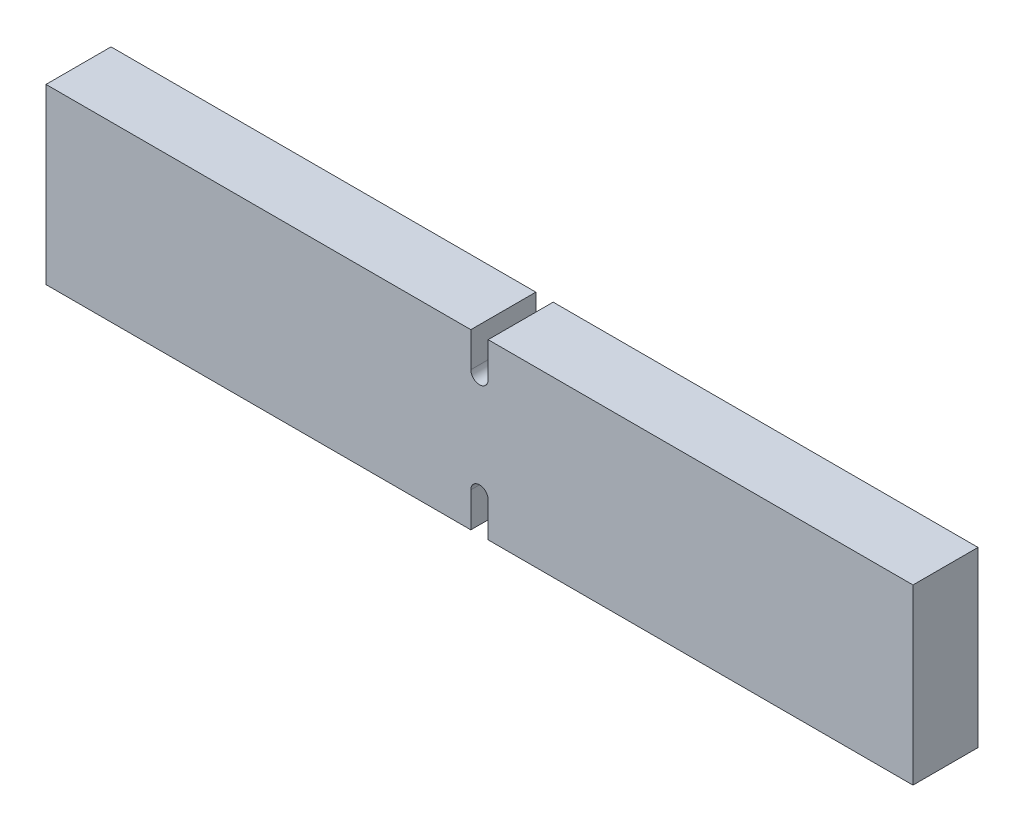
ISO-10303-21;
HEADER;
FILE_DESCRIPTION(('STEP AP214'),'2;1');
FILE_NAME('part.step','',(''),(''),'','','');
FILE_SCHEMA(('AUTOMOTIVE_DESIGN { 1 0 10303 214 1 1 1 1 }'));
ENDSEC;
DATA;
#1=APPLICATION_CONTEXT('core data for automotive mechanical design processes');
#2=APPLICATION_PROTOCOL_DEFINITION('international standard','automotive_design',2000,#1);
#3=PRODUCT_CONTEXT('',#1,'mechanical');
#4=PRODUCT('Part','Part','',(#3));
#5=PRODUCT_RELATED_PRODUCT_CATEGORY('part','',(#4));
#6=PRODUCT_DEFINITION_FORMATION('','',#4);
#7=PRODUCT_DEFINITION_CONTEXT('part definition',#1,'design');
#8=PRODUCT_DEFINITION('design','',#6,#7);
#9=PRODUCT_DEFINITION_SHAPE('','',#8);
#10=(LENGTH_UNIT() NAMED_UNIT(*) SI_UNIT(.MILLI.,.METRE.));
#11=(NAMED_UNIT(*) PLANE_ANGLE_UNIT() SI_UNIT($,.RADIAN.));
#12=(NAMED_UNIT(*) SI_UNIT($,.STERADIAN.) SOLID_ANGLE_UNIT());
#13=UNCERTAINTY_MEASURE_WITH_UNIT(LENGTH_MEASURE(1.E-05),#10,'distance_accuracy_value','');
#14=(GEOMETRIC_REPRESENTATION_CONTEXT(3) GLOBAL_UNCERTAINTY_ASSIGNED_CONTEXT((#13)) GLOBAL_UNIT_ASSIGNED_CONTEXT((#10,
#11,#12)) REPRESENTATION_CONTEXT('',''));
#15=CARTESIAN_POINT('',(0.,0.,0.));
#16=DIRECTION('',(0.,0.,1.));
#17=DIRECTION('',(1.,0.,0.));
#18=AXIS2_PLACEMENT_3D('',#15,#16,#17);
#19=CARTESIAN_POINT('',(-100.,-20.,15.));
#20=DIRECTION('',(0.,1.,0.));
#21=DIRECTION('',(-1.,0.,0.));
#22=AXIS2_PLACEMENT_3D('',#19,#20,#21);
#23=PLANE('',#22);
#24=DIRECTION('',(1.,0.,0.));
#25=VECTOR('',#24,1.);
#26=CARTESIAN_POINT('',(-100.,-20.,0.));
#27=LINE('',#26,#25);
#28=CARTESIAN_POINT('',(-100.,-20.,0.));
#29=VERTEX_POINT('',#28);
#30=CARTESIAN_POINT('',(-2.,-20.,0.));
#31=VERTEX_POINT('',#30);
#32=EDGE_CURVE('E144',#29,#31,#27,.T.);
#33=ORIENTED_EDGE('',*,*,#32,.T.);
#34=DIRECTION('',(0.,0.,1.));
#35=VECTOR('',#34,1.);
#36=CARTESIAN_POINT('',(-2.,-20.,0.));
#37=LINE('',#36,#35);
#38=CARTESIAN_POINT('',(-2.,-20.,15.));
#39=VERTEX_POINT('',#38);
#40=EDGE_CURVE('E213',#31,#39,#37,.T.);
#41=ORIENTED_EDGE('',*,*,#40,.T.);
#42=DIRECTION('',(1.,0.,0.));
#43=VECTOR('',#42,1.);
#44=CARTESIAN_POINT('',(-100.,-20.,15.));
#45=LINE('',#44,#43);
#46=CARTESIAN_POINT('',(-100.,-20.,15.));
#47=VERTEX_POINT('',#46);
#48=EDGE_CURVE('E174',#47,#39,#45,.T.);
#49=ORIENTED_EDGE('',*,*,#48,.F.);
#50=DIRECTION('',(0.,0.,-1.));
#51=VECTOR('',#50,1.);
#52=CARTESIAN_POINT('',(-100.,-20.,15.));
#53=LINE('',#52,#51);
#54=EDGE_CURVE('E11',#47,#29,#53,.T.);
#55=ORIENTED_EDGE('',*,*,#54,.T.);
#56=EDGE_LOOP('',(#33,#41,#49,#55));
#57=FACE_BOUND('',#56,.T.);
#58=ADVANCED_FACE('F32',(#57),#23,.F.);
#59=CARTESIAN_POINT('',(-100.,20.,15.));
#60=DIRECTION('',(0.,-1.,0.));
#61=DIRECTION('',(0.,0.,-1.));
#62=AXIS2_PLACEMENT_3D('',#59,#60,#61);
#63=PLANE('',#62);
#64=DIRECTION('',(-1.,0.,0.));
#65=VECTOR('',#64,1.);
#66=CARTESIAN_POINT('',(-100.,20.,0.));
#67=LINE('',#66,#65);
#68=CARTESIAN_POINT('',(100.,20.,0.));
#69=VERTEX_POINT('',#68);
#70=CARTESIAN_POINT('',(2.,20.,0.));
#71=VERTEX_POINT('',#70);
#72=EDGE_CURVE('E155',#69,#71,#67,.T.);
#73=ORIENTED_EDGE('',*,*,#72,.T.);
#74=DIRECTION('',(0.,0.,1.));
#75=VECTOR('',#74,1.);
#76=CARTESIAN_POINT('',(2.,20.,0.));
#77=LINE('',#76,#75);
#78=CARTESIAN_POINT('',(2.,20.,15.));
#79=VERTEX_POINT('',#78);
#80=EDGE_CURVE('E149',#71,#79,#77,.T.);
#81=ORIENTED_EDGE('',*,*,#80,.T.);
#82=DIRECTION('',(-1.,0.,0.));
#83=VECTOR('',#82,1.);
#84=CARTESIAN_POINT('',(-100.,20.,15.));
#85=LINE('',#84,#83);
#86=CARTESIAN_POINT('',(100.,20.,15.));
#87=VERTEX_POINT('',#86);
#88=EDGE_CURVE('E163',#87,#79,#85,.T.);
#89=ORIENTED_EDGE('',*,*,#88,.F.);
#90=DIRECTION('',(0.,0.,-1.));
#91=VECTOR('',#90,1.);
#92=CARTESIAN_POINT('',(100.,20.,15.));
#93=LINE('',#92,#91);
#94=EDGE_CURVE('E162',#87,#69,#93,.T.);
#95=ORIENTED_EDGE('',*,*,#94,.T.);
#96=EDGE_LOOP('',(#73,#81,#89,#95));
#97=FACE_BOUND('',#96,.T.);
#98=ADVANCED_FACE('F186',(#97),#63,.F.);
#99=CARTESIAN_POINT('',(-100.,20.,15.));
#100=DIRECTION('',(1.,0.,0.));
#101=DIRECTION('',(0.,0.,-1.));
#102=AXIS2_PLACEMENT_3D('',#99,#100,#101);
#103=PLANE('',#102);
#104=DIRECTION('',(0.,-1.,0.));
#105=VECTOR('',#104,1.);
#106=CARTESIAN_POINT('',(-100.,20.,0.));
#107=LINE('',#106,#105);
#108=CARTESIAN_POINT('',(-100.,20.,0.));
#109=VERTEX_POINT('',#108);
#110=EDGE_CURVE('E145',#109,#29,#107,.T.);
#111=ORIENTED_EDGE('',*,*,#110,.T.);
#112=ORIENTED_EDGE('',*,*,#54,.F.);
#113=DIRECTION('',(0.,-1.,0.));
#114=VECTOR('',#113,1.);
#115=CARTESIAN_POINT('',(-100.,20.,15.));
#116=LINE('',#115,#114);
#117=CARTESIAN_POINT('',(-100.,20.,15.));
#118=VERTEX_POINT('',#117);
#119=EDGE_CURVE('E158',#118,#47,#116,.T.);
#120=ORIENTED_EDGE('',*,*,#119,.F.);
#121=DIRECTION('',(0.,0.,-1.));
#122=VECTOR('',#121,1.);
#123=CARTESIAN_POINT('',(-100.,20.,15.));
#124=LINE('',#123,#122);
#125=EDGE_CURVE('E159',#118,#109,#124,.T.);
#126=ORIENTED_EDGE('',*,*,#125,.T.);
#127=EDGE_LOOP('',(#111,#112,#120,#126));
#128=FACE_BOUND('',#127,.T.);
#129=ADVANCED_FACE('F34',(#128),#103,.F.);
#130=CARTESIAN_POINT('',(2.,-20.,15.));
#131=VERTEX_POINT('',#130);
#132=CARTESIAN_POINT('',(100.,-20.,15.));
#133=VERTEX_POINT('',#132);
#134=EDGE_CURVE('E137',#131,#133,#45,.T.);
#135=ORIENTED_EDGE('',*,*,#134,.F.);
#136=DIRECTION('',(0.,0.,1.));
#137=VECTOR('',#136,1.);
#138=CARTESIAN_POINT('',(2.,-20.,0.));
#139=LINE('',#138,#137);
#140=CARTESIAN_POINT('',(2.,-20.,0.));
#141=VERTEX_POINT('',#140);
#142=EDGE_CURVE('E124',#141,#131,#139,.T.);
#143=ORIENTED_EDGE('',*,*,#142,.F.);
#144=CARTESIAN_POINT('',(100.,-20.,0.));
#145=VERTEX_POINT('',#144);
#146=EDGE_CURVE('E135',#141,#145,#27,.T.);
#147=ORIENTED_EDGE('',*,*,#146,.T.);
#148=DIRECTION('',(0.,0.,-1.));
#149=VECTOR('',#148,1.);
#150=CARTESIAN_POINT('',(100.,-20.,15.));
#151=LINE('',#150,#149);
#152=EDGE_CURVE('E40',#133,#145,#151,.T.);
#153=ORIENTED_EDGE('',*,*,#152,.F.);
#154=EDGE_LOOP('',(#135,#143,#147,#153));
#155=FACE_BOUND('',#154,.T.);
#156=ADVANCED_FACE('F133',(#155),#23,.F.);
#157=CARTESIAN_POINT('',(100.,20.,15.));
#158=DIRECTION('',(-1.,0.,0.));
#159=DIRECTION('',(0.,0.,1.));
#160=AXIS2_PLACEMENT_3D('',#157,#158,#159);
#161=PLANE('',#160);
#162=DIRECTION('',(0.,1.,0.));
#163=VECTOR('',#162,1.);
#164=CARTESIAN_POINT('',(100.,20.,0.));
#165=LINE('',#164,#163);
#166=EDGE_CURVE('E143',#145,#69,#165,.T.);
#167=ORIENTED_EDGE('',*,*,#166,.T.);
#168=ORIENTED_EDGE('',*,*,#94,.F.);
#169=DIRECTION('',(0.,1.,0.));
#170=VECTOR('',#169,1.);
#171=CARTESIAN_POINT('',(100.,20.,15.));
#172=LINE('',#171,#170);
#173=EDGE_CURVE('E169',#133,#87,#172,.T.);
#174=ORIENTED_EDGE('',*,*,#173,.F.);
#175=ORIENTED_EDGE('',*,*,#152,.T.);
#176=EDGE_LOOP('',(#167,#168,#174,#175));
#177=FACE_BOUND('',#176,.T.);
#178=ADVANCED_FACE('F167',(#177),#161,.F.);
#179=CARTESIAN_POINT('',(-2.,20.,15.));
#180=VERTEX_POINT('',#179);
#181=EDGE_CURVE('E173',#180,#118,#85,.T.);
#182=ORIENTED_EDGE('',*,*,#181,.F.);
#183=DIRECTION('',(0.,0.,1.));
#184=VECTOR('',#183,1.);
#185=CARTESIAN_POINT('',(-2.,20.,0.));
#186=LINE('',#185,#184);
#187=CARTESIAN_POINT('',(-2.,20.,0.));
#188=VERTEX_POINT('',#187);
#189=EDGE_CURVE('E198',#188,#180,#186,.T.);
#190=ORIENTED_EDGE('',*,*,#189,.F.);
#191=EDGE_CURVE('E154',#188,#109,#67,.T.);
#192=ORIENTED_EDGE('',*,*,#191,.T.);
#193=ORIENTED_EDGE('',*,*,#125,.F.);
#194=EDGE_LOOP('',(#182,#190,#192,#193));
#195=FACE_BOUND('',#194,.T.);
#196=ADVANCED_FACE('F247',(#195),#63,.F.);
#197=CARTESIAN_POINT('',(0.,0.,15.));
#198=DIRECTION('',(0.,0.,1.));
#199=DIRECTION('',(1.,0.,0.));
#200=AXIS2_PLACEMENT_3D('',#197,#198,#199);
#201=PLANE('',#200);
#202=DIRECTION('',(0.,-1.,0.));
#203=VECTOR('',#202,1.);
#204=CARTESIAN_POINT('',(-2.,-20.,15.));
#205=LINE('',#204,#203);
#206=CARTESIAN_POINT('',(-2.,-12.,15.));
#207=VERTEX_POINT('',#206);
#208=EDGE_CURVE('E129',#207,#39,#205,.T.);
#209=ORIENTED_EDGE('',*,*,#208,.F.);
#210=CARTESIAN_POINT('',(0.,-12.,15.));
#211=DIRECTION('',(0.,0.,1.));
#212=DIRECTION('',(-1.,0.,0.));
#213=AXIS2_PLACEMENT_3D('',#210,#211,#212);
#214=CIRCLE('',#213,2.);
#215=CARTESIAN_POINT('',(2.,-12.,15.));
#216=VERTEX_POINT('',#215);
#217=EDGE_CURVE('E206',#216,#207,#214,.T.);
#218=ORIENTED_EDGE('',*,*,#217,.F.);
#219=DIRECTION('',(0.,1.,0.));
#220=VECTOR('',#219,1.);
#221=CARTESIAN_POINT('',(2.,-20.,15.));
#222=LINE('',#221,#220);
#223=EDGE_CURVE('E204',#131,#216,#222,.T.);
#224=ORIENTED_EDGE('',*,*,#223,.F.);
#225=ORIENTED_EDGE('',*,*,#134,.T.);
#226=ORIENTED_EDGE('',*,*,#173,.T.);
#227=ORIENTED_EDGE('',*,*,#88,.T.);
#228=DIRECTION('',(0.,1.,0.));
#229=VECTOR('',#228,1.);
#230=CARTESIAN_POINT('',(2.,20.,15.));
#231=LINE('',#230,#229);
#232=CARTESIAN_POINT('',(2.,12.,15.));
#233=VERTEX_POINT('',#232);
#234=EDGE_CURVE('E183',#233,#79,#231,.T.);
#235=ORIENTED_EDGE('',*,*,#234,.F.);
#236=CARTESIAN_POINT('',(0.,12.,15.));
#237=DIRECTION('',(0.,0.,1.));
#238=DIRECTION('',(-1.,0.,0.));
#239=AXIS2_PLACEMENT_3D('',#236,#237,#238);
#240=CIRCLE('',#239,2.);
#241=CARTESIAN_POINT('',(-2.,12.,15.));
#242=VERTEX_POINT('',#241);
#243=EDGE_CURVE('E226',#242,#233,#240,.T.);
#244=ORIENTED_EDGE('',*,*,#243,.F.);
#245=DIRECTION('',(0.,-1.,0.));
#246=VECTOR('',#245,1.);
#247=CARTESIAN_POINT('',(-2.,20.,15.));
#248=LINE('',#247,#246);
#249=EDGE_CURVE('E216',#180,#242,#248,.T.);
#250=ORIENTED_EDGE('',*,*,#249,.F.);
#251=ORIENTED_EDGE('',*,*,#181,.T.);
#252=ORIENTED_EDGE('',*,*,#119,.T.);
#253=ORIENTED_EDGE('',*,*,#48,.T.);
#254=EDGE_LOOP('',(#209,#218,#224,#225,#226,#227,#235,#244,#250,#251,#252,#253));
#255=FACE_BOUND('',#254,.T.);
#256=ADVANCED_FACE('F181',(#255),#201,.T.);
#257=CARTESIAN_POINT('',(0.,0.,0.));
#258=DIRECTION('',(0.,0.,1.));
#259=DIRECTION('',(1.,0.,0.));
#260=AXIS2_PLACEMENT_3D('',#257,#258,#259);
#261=PLANE('',#260);
#262=CARTESIAN_POINT('',(0.,-12.,0.));
#263=DIRECTION('',(0.,0.,1.));
#264=DIRECTION('',(-1.,0.,0.));
#265=AXIS2_PLACEMENT_3D('',#262,#263,#264);
#266=CIRCLE('',#265,2.);
#267=CARTESIAN_POINT('',(2.,-12.,0.));
#268=VERTEX_POINT('',#267);
#269=CARTESIAN_POINT('',(-2.,-12.,0.));
#270=VERTEX_POINT('',#269);
#271=EDGE_CURVE('E47',#268,#270,#266,.T.);
#272=ORIENTED_EDGE('',*,*,#271,.T.);
#273=DIRECTION('',(0.,-1.,0.));
#274=VECTOR('',#273,1.);
#275=CARTESIAN_POINT('',(-2.,-20.,0.));
#276=LINE('',#275,#274);
#277=EDGE_CURVE('E138',#270,#31,#276,.T.);
#278=ORIENTED_EDGE('',*,*,#277,.T.);
#279=ORIENTED_EDGE('',*,*,#32,.F.);
#280=ORIENTED_EDGE('',*,*,#110,.F.);
#281=ORIENTED_EDGE('',*,*,#191,.F.);
#282=DIRECTION('',(0.,-1.,0.));
#283=VECTOR('',#282,1.);
#284=CARTESIAN_POINT('',(-2.,20.,0.));
#285=LINE('',#284,#283);
#286=CARTESIAN_POINT('',(-2.,12.,0.));
#287=VERTEX_POINT('',#286);
#288=EDGE_CURVE('E220',#188,#287,#285,.T.);
#289=ORIENTED_EDGE('',*,*,#288,.T.);
#290=CARTESIAN_POINT('',(0.,12.,0.));
#291=DIRECTION('',(0.,0.,1.));
#292=DIRECTION('',(-1.,0.,0.));
#293=AXIS2_PLACEMENT_3D('',#290,#291,#292);
#294=CIRCLE('',#293,2.);
#295=CARTESIAN_POINT('',(2.,12.,0.));
#296=VERTEX_POINT('',#295);
#297=EDGE_CURVE('E55',#287,#296,#294,.T.);
#298=ORIENTED_EDGE('',*,*,#297,.T.);
#299=DIRECTION('',(0.,1.,0.));
#300=VECTOR('',#299,1.);
#301=CARTESIAN_POINT('',(2.,20.,0.));
#302=LINE('',#301,#300);
#303=EDGE_CURVE('E199',#296,#71,#302,.T.);
#304=ORIENTED_EDGE('',*,*,#303,.T.);
#305=ORIENTED_EDGE('',*,*,#72,.F.);
#306=ORIENTED_EDGE('',*,*,#166,.F.);
#307=ORIENTED_EDGE('',*,*,#146,.F.);
#308=DIRECTION('',(0.,1.,0.));
#309=VECTOR('',#308,1.);
#310=CARTESIAN_POINT('',(2.,-20.,0.));
#311=LINE('',#310,#309);
#312=EDGE_CURVE('E120',#141,#268,#311,.T.);
#313=ORIENTED_EDGE('',*,*,#312,.T.);
#314=EDGE_LOOP('',(#272,#278,#279,#280,#281,#289,#298,#304,#305,#306,#307,#313));
#315=FACE_BOUND('',#314,.T.);
#316=ADVANCED_FACE('F141',(#315),#261,.F.);
#317=CARTESIAN_POINT('',(2.,20.,0.));
#318=DIRECTION('',(1.,0.,0.));
#319=DIRECTION('',(0.,1.,0.));
#320=AXIS2_PLACEMENT_3D('',#317,#318,#319);
#321=PLANE('',#320);
#322=ORIENTED_EDGE('',*,*,#234,.T.);
#323=ORIENTED_EDGE('',*,*,#80,.F.);
#324=ORIENTED_EDGE('',*,*,#303,.F.);
#325=DIRECTION('',(0.,0.,1.));
#326=VECTOR('',#325,1.);
#327=CARTESIAN_POINT('',(2.,12.,0.));
#328=LINE('',#327,#326);
#329=EDGE_CURVE('E190',#296,#233,#328,.T.);
#330=ORIENTED_EDGE('',*,*,#329,.T.);
#331=EDGE_LOOP('',(#322,#323,#324,#330));
#332=FACE_BOUND('',#331,.T.);
#333=ADVANCED_FACE('F228',(#332),#321,.F.);
#334=CARTESIAN_POINT('',(0.,12.,0.));
#335=DIRECTION('',(0.,0.,1.));
#336=DIRECTION('',(1.,0.,0.));
#337=AXIS2_PLACEMENT_3D('',#334,#335,#336);
#338=CYLINDRICAL_SURFACE('',#337,2.);
#339=ORIENTED_EDGE('',*,*,#243,.T.);
#340=ORIENTED_EDGE('',*,*,#329,.F.);
#341=ORIENTED_EDGE('',*,*,#297,.F.);
#342=DIRECTION('',(0.,0.,1.));
#343=VECTOR('',#342,1.);
#344=CARTESIAN_POINT('',(-2.,12.,0.));
#345=LINE('',#344,#343);
#346=EDGE_CURVE('E192',#287,#242,#345,.T.);
#347=ORIENTED_EDGE('',*,*,#346,.T.);
#348=EDGE_LOOP('',(#339,#340,#341,#347));
#349=FACE_BOUND('',#348,.T.);
#350=ADVANCED_FACE('F229',(#349),#338,.F.);
#351=CARTESIAN_POINT('',(-2.,20.,0.));
#352=DIRECTION('',(-1.,0.,0.));
#353=DIRECTION('',(0.,0.,1.));
#354=AXIS2_PLACEMENT_3D('',#351,#352,#353);
#355=PLANE('',#354);
#356=ORIENTED_EDGE('',*,*,#249,.T.);
#357=ORIENTED_EDGE('',*,*,#346,.F.);
#358=ORIENTED_EDGE('',*,*,#288,.F.);
#359=ORIENTED_EDGE('',*,*,#189,.T.);
#360=EDGE_LOOP('',(#356,#357,#358,#359));
#361=FACE_BOUND('',#360,.T.);
#362=ADVANCED_FACE('F231',(#361),#355,.F.);
#363=CARTESIAN_POINT('',(-2.,-20.,0.));
#364=DIRECTION('',(-1.,0.,0.));
#365=DIRECTION('',(0.,-1.,0.));
#366=AXIS2_PLACEMENT_3D('',#363,#364,#365);
#367=PLANE('',#366);
#368=ORIENTED_EDGE('',*,*,#208,.T.);
#369=ORIENTED_EDGE('',*,*,#40,.F.);
#370=ORIENTED_EDGE('',*,*,#277,.F.);
#371=DIRECTION('',(0.,0.,1.));
#372=VECTOR('',#371,1.);
#373=CARTESIAN_POINT('',(-2.,-12.,0.));
#374=LINE('',#373,#372);
#375=EDGE_CURVE('E217',#270,#207,#374,.T.);
#376=ORIENTED_EDGE('',*,*,#375,.T.);
#377=EDGE_LOOP('',(#368,#369,#370,#376));
#378=FACE_BOUND('',#377,.T.);
#379=ADVANCED_FACE('F237',(#378),#367,.F.);
#380=CARTESIAN_POINT('',(0.,-12.,0.));
#381=DIRECTION('',(0.,0.,1.));
#382=DIRECTION('',(1.,0.,0.));
#383=AXIS2_PLACEMENT_3D('',#380,#381,#382);
#384=CYLINDRICAL_SURFACE('',#383,2.);
#385=ORIENTED_EDGE('',*,*,#217,.T.);
#386=ORIENTED_EDGE('',*,*,#375,.F.);
#387=ORIENTED_EDGE('',*,*,#271,.F.);
#388=DIRECTION('',(0.,0.,1.));
#389=VECTOR('',#388,1.);
#390=CARTESIAN_POINT('',(2.,-12.,0.));
#391=LINE('',#390,#389);
#392=EDGE_CURVE('E126',#268,#216,#391,.T.);
#393=ORIENTED_EDGE('',*,*,#392,.T.);
#394=EDGE_LOOP('',(#385,#386,#387,#393));
#395=FACE_BOUND('',#394,.T.);
#396=ADVANCED_FACE('F263',(#395),#384,.F.);
#397=CARTESIAN_POINT('',(2.,-20.,0.));
#398=DIRECTION('',(1.,0.,0.));
#399=DIRECTION('',(0.,1.,0.));
#400=AXIS2_PLACEMENT_3D('',#397,#398,#399);
#401=PLANE('',#400);
#402=ORIENTED_EDGE('',*,*,#223,.T.);
#403=ORIENTED_EDGE('',*,*,#392,.F.);
#404=ORIENTED_EDGE('',*,*,#312,.F.);
#405=ORIENTED_EDGE('',*,*,#142,.T.);
#406=EDGE_LOOP('',(#402,#403,#404,#405));
#407=FACE_BOUND('',#406,.T.);
#408=ADVANCED_FACE('F123',(#407),#401,.F.);
#409=CLOSED_SHELL('',(#58,#98,#129,#156,#178,#196,#256,#316,#333,#350,#362,#379,#396,#408));
#410=MANIFOLD_SOLID_BREP('B2',#409);
#411=ADVANCED_BREP_SHAPE_REPRESENTATION('',(#18,#410),#14);
#412=SHAPE_DEFINITION_REPRESENTATION(#9,#411);
ENDSEC;
END-ISO-10303-21;
